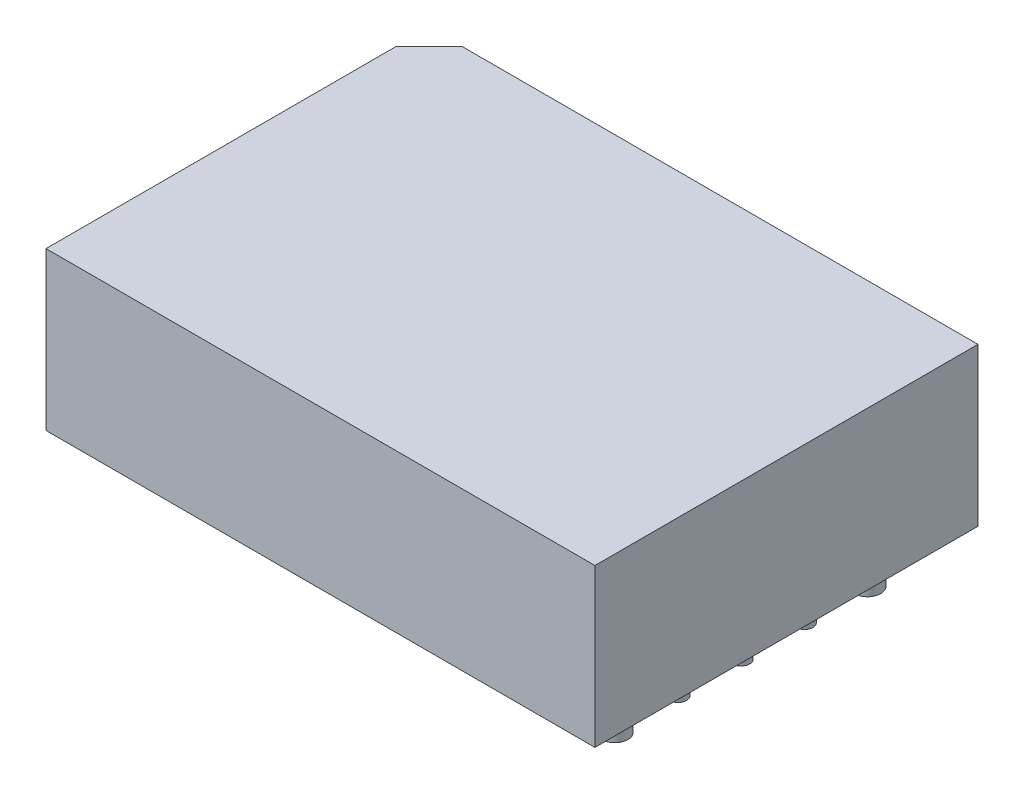
ISO-10303-21;
HEADER;
FILE_DESCRIPTION(('STEP AP214'),'2;1');
FILE_NAME('part.step','',(''),(''),'','','');
FILE_SCHEMA(('AUTOMOTIVE_DESIGN { 1 0 10303 214 1 1 1 1 }'));
ENDSEC;
DATA;
#1=APPLICATION_CONTEXT('core data for automotive mechanical design processes');
#2=APPLICATION_PROTOCOL_DEFINITION('international standard','automotive_design',2000,#1);
#3=PRODUCT_CONTEXT('',#1,'mechanical');
#4=PRODUCT('Part','Part','',(#3));
#5=PRODUCT_RELATED_PRODUCT_CATEGORY('part','',(#4));
#6=PRODUCT_DEFINITION_FORMATION('','',#4);
#7=PRODUCT_DEFINITION_CONTEXT('part definition',#1,'design');
#8=PRODUCT_DEFINITION('design','',#6,#7);
#9=PRODUCT_DEFINITION_SHAPE('','',#8);
#10=(LENGTH_UNIT() NAMED_UNIT(*) SI_UNIT(.MILLI.,.METRE.));
#11=(NAMED_UNIT(*) PLANE_ANGLE_UNIT() SI_UNIT($,.RADIAN.));
#12=(NAMED_UNIT(*) SI_UNIT($,.STERADIAN.) SOLID_ANGLE_UNIT());
#13=UNCERTAINTY_MEASURE_WITH_UNIT(LENGTH_MEASURE(1.E-05),#10,'distance_accuracy_value','');
#14=(GEOMETRIC_REPRESENTATION_CONTEXT(3) GLOBAL_UNCERTAINTY_ASSIGNED_CONTEXT((#13)) GLOBAL_UNIT_ASSIGNED_CONTEXT((#10,
#11,#12)) REPRESENTATION_CONTEXT('',''));
#15=CARTESIAN_POINT('',(0.,0.,0.));
#16=DIRECTION('',(0.,0.,1.));
#17=DIRECTION('',(1.,0.,0.));
#18=AXIS2_PLACEMENT_3D('',#15,#16,#17);
#19=CARTESIAN_POINT('',(0.,9.5,0.));
#20=DIRECTION('',(-1.,0.,0.));
#21=DIRECTION('',(0.,0.,1.));
#22=AXIS2_PLACEMENT_3D('',#19,#20,#21);
#23=PLANE('',#22);
#24=DIRECTION('',(0.,0.,-1.));
#25=VECTOR('',#24,1.);
#26=CARTESIAN_POINT('',(0.,0.,0.));
#27=LINE('',#26,#25);
#28=CARTESIAN_POINT('',(0.,0.,0.));
#29=VERTEX_POINT('',#28);
#30=CARTESIAN_POINT('',(0.,0.,-23.1));
#31=VERTEX_POINT('',#30);
#32=EDGE_CURVE('E115',#29,#31,#27,.T.);
#33=ORIENTED_EDGE('',*,*,#32,.T.);
#34=DIRECTION('',(0.,-1.,0.));
#35=VECTOR('',#34,1.);
#36=CARTESIAN_POINT('',(0.,9.5,-23.1));
#37=LINE('',#36,#35);
#38=CARTESIAN_POINT('',(0.,9.5,-23.1));
#39=VERTEX_POINT('',#38);
#40=EDGE_CURVE('E11',#39,#31,#37,.T.);
#41=ORIENTED_EDGE('',*,*,#40,.F.);
#42=DIRECTION('',(0.,0.,-1.));
#43=VECTOR('',#42,1.);
#44=CARTESIAN_POINT('',(0.,9.5,0.));
#45=LINE('',#44,#43);
#46=CARTESIAN_POINT('',(0.,9.5,0.));
#47=VERTEX_POINT('',#46);
#48=EDGE_CURVE('E124',#47,#39,#45,.T.);
#49=ORIENTED_EDGE('',*,*,#48,.F.);
#50=DIRECTION('',(0.,-1.,0.));
#51=VECTOR('',#50,1.);
#52=CARTESIAN_POINT('',(0.,9.5,0.));
#53=LINE('',#52,#51);
#54=EDGE_CURVE('E111',#47,#29,#53,.T.);
#55=ORIENTED_EDGE('',*,*,#54,.T.);
#56=EDGE_LOOP('',(#33,#41,#49,#55));
#57=FACE_BOUND('',#56,.T.);
#58=ADVANCED_FACE('F39',(#57),#23,.F.);
#59=CARTESIAN_POINT('',(0.,9.5,-23.1));
#60=DIRECTION('',(0.,0.,1.));
#61=DIRECTION('',(1.,0.,0.));
#62=AXIS2_PLACEMENT_3D('',#59,#60,#61);
#63=PLANE('',#62);
#64=DIRECTION('',(-1.,0.,0.));
#65=VECTOR('',#64,1.);
#66=CARTESIAN_POINT('',(0.,0.,-23.1));
#67=LINE('',#66,#65);
#68=CARTESIAN_POINT('',(-31.1,0.,-23.1));
#69=VERTEX_POINT('',#68);
#70=EDGE_CURVE('E118',#31,#69,#67,.T.);
#71=ORIENTED_EDGE('',*,*,#70,.T.);
#72=DIRECTION('',(0.,-1.,0.));
#73=VECTOR('',#72,1.);
#74=CARTESIAN_POINT('',(-31.1,9.5,-23.1));
#75=LINE('',#74,#73);
#76=CARTESIAN_POINT('',(-31.1,9.5,-23.1));
#77=VERTEX_POINT('',#76);
#78=EDGE_CURVE('E48',#77,#69,#75,.T.);
#79=ORIENTED_EDGE('',*,*,#78,.F.);
#80=DIRECTION('',(-1.,0.,0.));
#81=VECTOR('',#80,1.);
#82=CARTESIAN_POINT('',(0.,9.5,-23.1));
#83=LINE('',#82,#81);
#84=EDGE_CURVE('E91',#39,#77,#83,.T.);
#85=ORIENTED_EDGE('',*,*,#84,.F.);
#86=ORIENTED_EDGE('',*,*,#40,.T.);
#87=EDGE_LOOP('',(#71,#79,#85,#86));
#88=FACE_BOUND('',#87,.T.);
#89=ADVANCED_FACE('F179',(#88),#63,.F.);
#90=CARTESIAN_POINT('',(-31.1,9.5,-23.1));
#91=DIRECTION('',(0.707106781186548,0.,0.707106781186547));
#92=DIRECTION('',(0.707106781186547,0.,-0.707106781186548));
#93=AXIS2_PLACEMENT_3D('',#90,#91,#92);
#94=PLANE('',#93);
#95=DIRECTION('',(-0.707106781186547,0.,0.707106781186548));
#96=VECTOR('',#95,1.);
#97=CARTESIAN_POINT('',(-31.1,0.,-23.1));
#98=LINE('',#97,#96);
#99=CARTESIAN_POINT('',(-33.1,0.,-21.1));
#100=VERTEX_POINT('',#99);
#101=EDGE_CURVE('E106',#69,#100,#98,.T.);
#102=ORIENTED_EDGE('',*,*,#101,.T.);
#103=DIRECTION('',(0.,-1.,0.));
#104=VECTOR('',#103,1.);
#105=CARTESIAN_POINT('',(-33.1,9.5,-21.1));
#106=LINE('',#105,#104);
#107=CARTESIAN_POINT('',(-33.1,9.5,-21.1));
#108=VERTEX_POINT('',#107);
#109=EDGE_CURVE('E103',#108,#100,#106,.T.);
#110=ORIENTED_EDGE('',*,*,#109,.F.);
#111=DIRECTION('',(-0.707106781186547,0.,0.707106781186548));
#112=VECTOR('',#111,1.);
#113=CARTESIAN_POINT('',(-31.1,9.5,-23.1));
#114=LINE('',#113,#112);
#115=EDGE_CURVE('E95',#77,#108,#114,.T.);
#116=ORIENTED_EDGE('',*,*,#115,.F.);
#117=ORIENTED_EDGE('',*,*,#78,.T.);
#118=EDGE_LOOP('',(#102,#110,#116,#117));
#119=FACE_BOUND('',#118,.T.);
#120=ADVANCED_FACE('F104',(#119),#94,.F.);
#121=CARTESIAN_POINT('',(-33.1,9.5,0.));
#122=DIRECTION('',(1.,0.,0.));
#123=DIRECTION('',(0.,0.,-1.));
#124=AXIS2_PLACEMENT_3D('',#121,#122,#123);
#125=PLANE('',#124);
#126=DIRECTION('',(0.,0.,1.));
#127=VECTOR('',#126,1.);
#128=CARTESIAN_POINT('',(-33.1,0.,0.));
#129=LINE('',#128,#127);
#130=CARTESIAN_POINT('',(-33.1,0.,0.));
#131=VERTEX_POINT('',#130);
#132=EDGE_CURVE('E77',#100,#131,#129,.T.);
#133=ORIENTED_EDGE('',*,*,#132,.T.);
#134=DIRECTION('',(0.,-1.,0.));
#135=VECTOR('',#134,1.);
#136=CARTESIAN_POINT('',(-33.1,9.5,0.));
#137=LINE('',#136,#135);
#138=CARTESIAN_POINT('',(-33.1,9.5,0.));
#139=VERTEX_POINT('',#138);
#140=EDGE_CURVE('E107',#139,#131,#137,.T.);
#141=ORIENTED_EDGE('',*,*,#140,.F.);
#142=DIRECTION('',(0.,0.,1.));
#143=VECTOR('',#142,1.);
#144=CARTESIAN_POINT('',(-33.1,9.5,0.));
#145=LINE('',#144,#143);
#146=EDGE_CURVE('E99',#108,#139,#145,.T.);
#147=ORIENTED_EDGE('',*,*,#146,.F.);
#148=ORIENTED_EDGE('',*,*,#109,.T.);
#149=EDGE_LOOP('',(#133,#141,#147,#148));
#150=FACE_BOUND('',#149,.T.);
#151=ADVANCED_FACE('F109',(#150),#125,.F.);
#152=CARTESIAN_POINT('',(0.,9.5,0.));
#153=DIRECTION('',(0.,0.,-1.));
#154=DIRECTION('',(-1.,0.,0.));
#155=AXIS2_PLACEMENT_3D('',#152,#153,#154);
#156=PLANE('',#155);
#157=DIRECTION('',(1.,0.,0.));
#158=VECTOR('',#157,1.);
#159=CARTESIAN_POINT('',(0.,0.,0.));
#160=LINE('',#159,#158);
#161=EDGE_CURVE('E83',#131,#29,#160,.T.);
#162=ORIENTED_EDGE('',*,*,#161,.T.);
#163=ORIENTED_EDGE('',*,*,#54,.F.);
#164=DIRECTION('',(1.,0.,0.));
#165=VECTOR('',#164,1.);
#166=CARTESIAN_POINT('',(0.,9.5,0.));
#167=LINE('',#166,#165);
#168=EDGE_CURVE('E57',#139,#47,#167,.T.);
#169=ORIENTED_EDGE('',*,*,#168,.F.);
#170=ORIENTED_EDGE('',*,*,#140,.T.);
#171=EDGE_LOOP('',(#162,#163,#169,#170));
#172=FACE_BOUND('',#171,.T.);
#173=ADVANCED_FACE('F193',(#172),#156,.F.);
#174=CARTESIAN_POINT('',(0.,9.5,0.));
#175=DIRECTION('',(0.,1.,0.));
#176=DIRECTION('',(0.,0.,1.));
#177=AXIS2_PLACEMENT_3D('',#174,#175,#176);
#178=PLANE('',#177);
#179=ORIENTED_EDGE('',*,*,#48,.T.);
#180=ORIENTED_EDGE('',*,*,#84,.T.);
#181=ORIENTED_EDGE('',*,*,#115,.T.);
#182=ORIENTED_EDGE('',*,*,#146,.T.);
#183=ORIENTED_EDGE('',*,*,#168,.T.);
#184=EDGE_LOOP('',(#179,#180,#181,#182,#183));
#185=FACE_BOUND('',#184,.T.);
#186=ADVANCED_FACE('F97',(#185),#178,.T.);
#187=CARTESIAN_POINT('',(0.,0.,0.));
#188=DIRECTION('',(0.,1.,0.));
#189=DIRECTION('',(0.,0.,1.));
#190=AXIS2_PLACEMENT_3D('',#187,#188,#189);
#191=PLANE('',#190);
#192=CARTESIAN_POINT('',(-30.64,0.,-11.52));
#193=DIRECTION('',(0.,1.,0.));
#194=DIRECTION('',(0.,0.,1.));
#195=AXIS2_PLACEMENT_3D('',#192,#193,#194);
#196=CIRCLE('',#195,0.509999999999999);
#197=CARTESIAN_POINT('',(-30.64,0.,-11.01));
#198=VERTEX_POINT('',#197);
#199=EDGE_CURVE('E42',#198,#198,#196,.T.);
#200=ORIENTED_EDGE('',*,*,#199,.T.);
#201=EDGE_LOOP('',(#200));
#202=FACE_BOUND('',#201,.T.);
#203=CARTESIAN_POINT('',(-30.64,0.,-19.14));
#204=DIRECTION('',(0.,1.,0.));
#205=DIRECTION('',(0.,0.,1.));
#206=AXIS2_PLACEMENT_3D('',#203,#204,#205);
#207=CIRCLE('',#206,0.509999999999999);
#208=CARTESIAN_POINT('',(-30.64,0.,-18.63));
#209=VERTEX_POINT('',#208);
#210=EDGE_CURVE('E150',#209,#209,#207,.T.);
#211=ORIENTED_EDGE('',*,*,#210,.T.);
#212=EDGE_LOOP('',(#211));
#213=FACE_BOUND('',#212,.T.);
#214=CARTESIAN_POINT('',(-30.64,0.,-3.9));
#215=DIRECTION('',(0.,1.,0.));
#216=DIRECTION('',(0.,0.,1.));
#217=AXIS2_PLACEMENT_3D('',#214,#215,#216);
#218=CIRCLE('',#217,0.509999999999999);
#219=CARTESIAN_POINT('',(-30.64,0.,-3.39));
#220=VERTEX_POINT('',#219);
#221=EDGE_CURVE('E147',#220,#220,#218,.T.);
#222=ORIENTED_EDGE('',*,*,#221,.T.);
#223=EDGE_LOOP('',(#222));
#224=FACE_BOUND('',#223,.T.);
#225=CARTESIAN_POINT('',(-2.7,0.,-11.52));
#226=DIRECTION('',(0.,1.,0.));
#227=DIRECTION('',(0.,0.,1.));
#228=AXIS2_PLACEMENT_3D('',#225,#226,#227);
#229=CIRCLE('',#228,0.51);
#230=CARTESIAN_POINT('',(-2.7,0.,-11.01));
#231=VERTEX_POINT('',#230);
#232=EDGE_CURVE('E143',#231,#231,#229,.T.);
#233=ORIENTED_EDGE('',*,*,#232,.T.);
#234=EDGE_LOOP('',(#233));
#235=FACE_BOUND('',#234,.T.);
#236=CARTESIAN_POINT('',(-2.7,0.,-7.71));
#237=DIRECTION('',(0.,1.,0.));
#238=DIRECTION('',(0.,0.,1.));
#239=AXIS2_PLACEMENT_3D('',#236,#237,#238);
#240=CIRCLE('',#239,0.51);
#241=CARTESIAN_POINT('',(-2.7,0.,-7.2));
#242=VERTEX_POINT('',#241);
#243=EDGE_CURVE('E139',#242,#242,#240,.T.);
#244=ORIENTED_EDGE('',*,*,#243,.T.);
#245=EDGE_LOOP('',(#244));
#246=FACE_BOUND('',#245,.T.);
#247=CARTESIAN_POINT('',(-2.7,0.,-3.9));
#248=DIRECTION('',(0.,1.,0.));
#249=DIRECTION('',(0.,0.,1.));
#250=AXIS2_PLACEMENT_3D('',#247,#248,#249);
#251=CIRCLE('',#250,0.785);
#252=CARTESIAN_POINT('',(-2.7,0.,-3.115));
#253=VERTEX_POINT('',#252);
#254=EDGE_CURVE('E135',#253,#253,#251,.T.);
#255=ORIENTED_EDGE('',*,*,#254,.T.);
#256=EDGE_LOOP('',(#255));
#257=FACE_BOUND('',#256,.T.);
#258=CARTESIAN_POINT('',(-2.7,0.,-15.33));
#259=DIRECTION('',(0.,1.,0.));
#260=DIRECTION('',(0.,0.,1.));
#261=AXIS2_PLACEMENT_3D('',#258,#259,#260);
#262=CIRCLE('',#261,0.51);
#263=CARTESIAN_POINT('',(-2.7,0.,-14.82));
#264=VERTEX_POINT('',#263);
#265=EDGE_CURVE('E131',#264,#264,#262,.T.);
#266=ORIENTED_EDGE('',*,*,#265,.T.);
#267=EDGE_LOOP('',(#266));
#268=FACE_BOUND('',#267,.T.);
#269=CARTESIAN_POINT('',(-2.7,0.,-19.14));
#270=DIRECTION('',(0.,1.,0.));
#271=DIRECTION('',(0.,0.,1.));
#272=AXIS2_PLACEMENT_3D('',#269,#270,#271);
#273=CIRCLE('',#272,0.785);
#274=CARTESIAN_POINT('',(-2.7,0.,-18.355));
#275=VERTEX_POINT('',#274);
#276=EDGE_CURVE('E119',#275,#275,#273,.T.);
#277=ORIENTED_EDGE('',*,*,#276,.T.);
#278=EDGE_LOOP('',(#277));
#279=FACE_BOUND('',#278,.T.);
#280=ORIENTED_EDGE('',*,*,#32,.F.);
#281=ORIENTED_EDGE('',*,*,#161,.F.);
#282=ORIENTED_EDGE('',*,*,#132,.F.);
#283=ORIENTED_EDGE('',*,*,#101,.F.);
#284=ORIENTED_EDGE('',*,*,#70,.F.);
#285=EDGE_LOOP('',(#280,#281,#282,#283,#284));
#286=FACE_BOUND('',#285,.T.);
#287=ADVANCED_FACE('F181',(#202,#213,#224,#235,#246,#257,#268,#279,#286),#191,.F.);
#288=CARTESIAN_POINT('',(-2.7,-2.5,-19.14));
#289=DIRECTION('',(0.,1.,0.));
#290=DIRECTION('',(0.,0.,1.));
#291=AXIS2_PLACEMENT_3D('',#288,#289,#290);
#292=CYLINDRICAL_SURFACE('',#291,0.785);
#293=CARTESIAN_POINT('',(-2.7,-2.5,-19.14));
#294=DIRECTION('',(0.,1.,0.));
#295=DIRECTION('',(0.,0.,1.));
#296=AXIS2_PLACEMENT_3D('',#293,#294,#295);
#297=CIRCLE('',#296,0.785);
#298=CARTESIAN_POINT('',(-2.7,-2.5,-18.355));
#299=VERTEX_POINT('',#298);
#300=EDGE_CURVE('E130',#299,#299,#297,.T.);
#301=ORIENTED_EDGE('',*,*,#300,.T.);
#302=EDGE_LOOP('',(#301));
#303=FACE_BOUND('',#302,.T.);
#304=ORIENTED_EDGE('',*,*,#276,.F.);
#305=EDGE_LOOP('',(#304));
#306=FACE_BOUND('',#305,.T.);
#307=ADVANCED_FACE('F183',(#303,#306),#292,.T.);
#308=CARTESIAN_POINT('',(0.,-2.5,0.));
#309=DIRECTION('',(0.,1.,0.));
#310=DIRECTION('',(0.,0.,1.));
#311=AXIS2_PLACEMENT_3D('',#308,#309,#310);
#312=PLANE('',#311);
#313=ORIENTED_EDGE('',*,*,#300,.F.);
#314=EDGE_LOOP('',(#313));
#315=FACE_BOUND('',#314,.T.);
#316=ADVANCED_FACE('F190',(#315),#312,.F.);
#317=CARTESIAN_POINT('',(-2.7,-2.5,-15.33));
#318=DIRECTION('',(0.,1.,0.));
#319=DIRECTION('',(0.,0.,1.));
#320=AXIS2_PLACEMENT_3D('',#317,#318,#319);
#321=CYLINDRICAL_SURFACE('',#320,0.51);
#322=CARTESIAN_POINT('',(-2.7,-2.5,-15.33));
#323=DIRECTION('',(0.,1.,0.));
#324=DIRECTION('',(0.,0.,1.));
#325=AXIS2_PLACEMENT_3D('',#322,#323,#324);
#326=CIRCLE('',#325,0.51);
#327=CARTESIAN_POINT('',(-2.7,-2.5,-14.82));
#328=VERTEX_POINT('',#327);
#329=EDGE_CURVE('E134',#328,#328,#326,.T.);
#330=ORIENTED_EDGE('',*,*,#329,.T.);
#331=EDGE_LOOP('',(#330));
#332=FACE_BOUND('',#331,.T.);
#333=ORIENTED_EDGE('',*,*,#265,.F.);
#334=EDGE_LOOP('',(#333));
#335=FACE_BOUND('',#334,.T.);
#336=ADVANCED_FACE('F237',(#332,#335),#321,.T.);
#337=CARTESIAN_POINT('',(0.,-2.5,0.));
#338=DIRECTION('',(0.,1.,0.));
#339=DIRECTION('',(0.,0.,1.));
#340=AXIS2_PLACEMENT_3D('',#337,#338,#339);
#341=PLANE('',#340);
#342=ORIENTED_EDGE('',*,*,#329,.F.);
#343=EDGE_LOOP('',(#342));
#344=FACE_BOUND('',#343,.T.);
#345=ADVANCED_FACE('F248',(#344),#341,.F.);
#346=CARTESIAN_POINT('',(-2.7,-2.5,-3.9));
#347=DIRECTION('',(0.,1.,0.));
#348=DIRECTION('',(0.,0.,1.));
#349=AXIS2_PLACEMENT_3D('',#346,#347,#348);
#350=CYLINDRICAL_SURFACE('',#349,0.785);
#351=CARTESIAN_POINT('',(-2.7,-2.5,-3.9));
#352=DIRECTION('',(0.,1.,0.));
#353=DIRECTION('',(0.,0.,1.));
#354=AXIS2_PLACEMENT_3D('',#351,#352,#353);
#355=CIRCLE('',#354,0.785);
#356=CARTESIAN_POINT('',(-2.7,-2.5,-3.115));
#357=VERTEX_POINT('',#356);
#358=EDGE_CURVE('E138',#357,#357,#355,.T.);
#359=ORIENTED_EDGE('',*,*,#358,.T.);
#360=EDGE_LOOP('',(#359));
#361=FACE_BOUND('',#360,.T.);
#362=ORIENTED_EDGE('',*,*,#254,.F.);
#363=EDGE_LOOP('',(#362));
#364=FACE_BOUND('',#363,.T.);
#365=ADVANCED_FACE('F259',(#361,#364),#350,.T.);
#366=CARTESIAN_POINT('',(0.,-2.5,0.));
#367=DIRECTION('',(0.,1.,0.));
#368=DIRECTION('',(0.,0.,1.));
#369=AXIS2_PLACEMENT_3D('',#366,#367,#368);
#370=PLANE('',#369);
#371=ORIENTED_EDGE('',*,*,#358,.F.);
#372=EDGE_LOOP('',(#371));
#373=FACE_BOUND('',#372,.T.);
#374=ADVANCED_FACE('F270',(#373),#370,.F.);
#375=CARTESIAN_POINT('',(-2.7,-2.5,-7.71));
#376=DIRECTION('',(0.,1.,0.));
#377=DIRECTION('',(0.,0.,1.));
#378=AXIS2_PLACEMENT_3D('',#375,#376,#377);
#379=CYLINDRICAL_SURFACE('',#378,0.51);
#380=CARTESIAN_POINT('',(-2.7,-2.5,-7.71));
#381=DIRECTION('',(0.,1.,0.));
#382=DIRECTION('',(0.,0.,1.));
#383=AXIS2_PLACEMENT_3D('',#380,#381,#382);
#384=CIRCLE('',#383,0.51);
#385=CARTESIAN_POINT('',(-2.7,-2.5,-7.2));
#386=VERTEX_POINT('',#385);
#387=EDGE_CURVE('E142',#386,#386,#384,.T.);
#388=ORIENTED_EDGE('',*,*,#387,.T.);
#389=EDGE_LOOP('',(#388));
#390=FACE_BOUND('',#389,.T.);
#391=ORIENTED_EDGE('',*,*,#243,.F.);
#392=EDGE_LOOP('',(#391));
#393=FACE_BOUND('',#392,.T.);
#394=ADVANCED_FACE('F281',(#390,#393),#379,.T.);
#395=CARTESIAN_POINT('',(0.,-2.5,0.));
#396=DIRECTION('',(0.,1.,0.));
#397=DIRECTION('',(0.,0.,1.));
#398=AXIS2_PLACEMENT_3D('',#395,#396,#397);
#399=PLANE('',#398);
#400=ORIENTED_EDGE('',*,*,#387,.F.);
#401=EDGE_LOOP('',(#400));
#402=FACE_BOUND('',#401,.T.);
#403=ADVANCED_FACE('F292',(#402),#399,.F.);
#404=CARTESIAN_POINT('',(-2.7,-2.5,-11.52));
#405=DIRECTION('',(0.,1.,0.));
#406=DIRECTION('',(0.,0.,1.));
#407=AXIS2_PLACEMENT_3D('',#404,#405,#406);
#408=CYLINDRICAL_SURFACE('',#407,0.51);
#409=CARTESIAN_POINT('',(-2.7,-2.5,-11.52));
#410=DIRECTION('',(0.,1.,0.));
#411=DIRECTION('',(0.,0.,1.));
#412=AXIS2_PLACEMENT_3D('',#409,#410,#411);
#413=CIRCLE('',#412,0.51);
#414=CARTESIAN_POINT('',(-2.7,-2.5,-11.01));
#415=VERTEX_POINT('',#414);
#416=EDGE_CURVE('E146',#415,#415,#413,.T.);
#417=ORIENTED_EDGE('',*,*,#416,.T.);
#418=EDGE_LOOP('',(#417));
#419=FACE_BOUND('',#418,.T.);
#420=ORIENTED_EDGE('',*,*,#232,.F.);
#421=EDGE_LOOP('',(#420));
#422=FACE_BOUND('',#421,.T.);
#423=ADVANCED_FACE('F303',(#419,#422),#408,.T.);
#424=CARTESIAN_POINT('',(0.,-2.5,0.));
#425=DIRECTION('',(0.,1.,0.));
#426=DIRECTION('',(0.,0.,1.));
#427=AXIS2_PLACEMENT_3D('',#424,#425,#426);
#428=PLANE('',#427);
#429=ORIENTED_EDGE('',*,*,#416,.F.);
#430=EDGE_LOOP('',(#429));
#431=FACE_BOUND('',#430,.T.);
#432=ADVANCED_FACE('F314',(#431),#428,.F.);
#433=CARTESIAN_POINT('',(-30.64,-2.5,-3.9));
#434=DIRECTION('',(0.,1.,0.));
#435=DIRECTION('',(0.,0.,1.));
#436=AXIS2_PLACEMENT_3D('',#433,#434,#435);
#437=CYLINDRICAL_SURFACE('',#436,0.509999999999999);
#438=CARTESIAN_POINT('',(-30.64,-2.5,-3.9));
#439=DIRECTION('',(0.,1.,0.));
#440=DIRECTION('',(0.,0.,1.));
#441=AXIS2_PLACEMENT_3D('',#438,#439,#440);
#442=CIRCLE('',#441,0.509999999999999);
#443=CARTESIAN_POINT('',(-30.64,-2.5,-3.39));
#444=VERTEX_POINT('',#443);
#445=EDGE_CURVE('E149',#444,#444,#442,.T.);
#446=ORIENTED_EDGE('',*,*,#445,.T.);
#447=EDGE_LOOP('',(#446));
#448=FACE_BOUND('',#447,.T.);
#449=ORIENTED_EDGE('',*,*,#221,.F.);
#450=EDGE_LOOP('',(#449));
#451=FACE_BOUND('',#450,.T.);
#452=ADVANCED_FACE('F325',(#448,#451),#437,.T.);
#453=CARTESIAN_POINT('',(0.,-2.5,0.));
#454=DIRECTION('',(0.,1.,0.));
#455=DIRECTION('',(0.,0.,1.));
#456=AXIS2_PLACEMENT_3D('',#453,#454,#455);
#457=PLANE('',#456);
#458=ORIENTED_EDGE('',*,*,#445,.F.);
#459=EDGE_LOOP('',(#458));
#460=FACE_BOUND('',#459,.T.);
#461=ADVANCED_FACE('F336',(#460),#457,.F.);
#462=CARTESIAN_POINT('',(-30.64,-2.5,-19.14));
#463=DIRECTION('',(0.,1.,0.));
#464=DIRECTION('',(0.,0.,1.));
#465=AXIS2_PLACEMENT_3D('',#462,#463,#464);
#466=CYLINDRICAL_SURFACE('',#465,0.509999999999999);
#467=CARTESIAN_POINT('',(-30.64,-2.5,-19.14));
#468=DIRECTION('',(0.,1.,0.));
#469=DIRECTION('',(0.,0.,1.));
#470=AXIS2_PLACEMENT_3D('',#467,#468,#469);
#471=CIRCLE('',#470,0.509999999999999);
#472=CARTESIAN_POINT('',(-30.64,-2.5,-18.63));
#473=VERTEX_POINT('',#472);
#474=EDGE_CURVE('E152',#473,#473,#471,.T.);
#475=ORIENTED_EDGE('',*,*,#474,.T.);
#476=EDGE_LOOP('',(#475));
#477=FACE_BOUND('',#476,.T.);
#478=ORIENTED_EDGE('',*,*,#210,.F.);
#479=EDGE_LOOP('',(#478));
#480=FACE_BOUND('',#479,.T.);
#481=ADVANCED_FACE('F347',(#477,#480),#466,.T.);
#482=CARTESIAN_POINT('',(0.,-2.5,0.));
#483=DIRECTION('',(0.,1.,0.));
#484=DIRECTION('',(0.,0.,1.));
#485=AXIS2_PLACEMENT_3D('',#482,#483,#484);
#486=PLANE('',#485);
#487=ORIENTED_EDGE('',*,*,#474,.F.);
#488=EDGE_LOOP('',(#487));
#489=FACE_BOUND('',#488,.T.);
#490=ADVANCED_FACE('F358',(#489),#486,.F.);
#491=CARTESIAN_POINT('',(-30.64,-2.5,-11.52));
#492=DIRECTION('',(0.,1.,0.));
#493=DIRECTION('',(0.,0.,1.));
#494=AXIS2_PLACEMENT_3D('',#491,#492,#493);
#495=CYLINDRICAL_SURFACE('',#494,0.509999999999999);
#496=CARTESIAN_POINT('',(-30.64,-2.5,-11.52));
#497=DIRECTION('',(0.,1.,0.));
#498=DIRECTION('',(0.,0.,1.));
#499=AXIS2_PLACEMENT_3D('',#496,#497,#498);
#500=CIRCLE('',#499,0.509999999999999);
#501=CARTESIAN_POINT('',(-30.64,-2.5,-11.01));
#502=VERTEX_POINT('',#501);
#503=EDGE_CURVE('E162',#502,#502,#500,.T.);
#504=ORIENTED_EDGE('',*,*,#503,.T.);
#505=EDGE_LOOP('',(#504));
#506=FACE_BOUND('',#505,.T.);
#507=ORIENTED_EDGE('',*,*,#199,.F.);
#508=EDGE_LOOP('',(#507));
#509=FACE_BOUND('',#508,.T.);
#510=ADVANCED_FACE('F368',(#506,#509),#495,.T.);
#511=CARTESIAN_POINT('',(-30.64,-2.5,-11.52));
#512=DIRECTION('',(0.,1.,0.));
#513=DIRECTION('',(0.,0.,1.));
#514=AXIS2_PLACEMENT_3D('',#511,#512,#513);
#515=PLANE('',#514);
#516=ORIENTED_EDGE('',*,*,#503,.F.);
#517=EDGE_LOOP('',(#516));
#518=FACE_BOUND('',#517,.T.);
#519=ADVANCED_FACE('F379',(#518),#515,.F.);
#520=CLOSED_SHELL('',(#58,#89,#120,#151,#173,#186,#287,#307,#316,#336,#345,#365,#374,#394,#403,
#423,#432,#452,#461,#481,#490,#510,#519));
#521=MANIFOLD_SOLID_BREP('B2',#520);
#522=ADVANCED_BREP_SHAPE_REPRESENTATION('',(#18,#521),#14);
#523=SHAPE_DEFINITION_REPRESENTATION(#9,#522);
ENDSEC;
END-ISO-10303-21;
